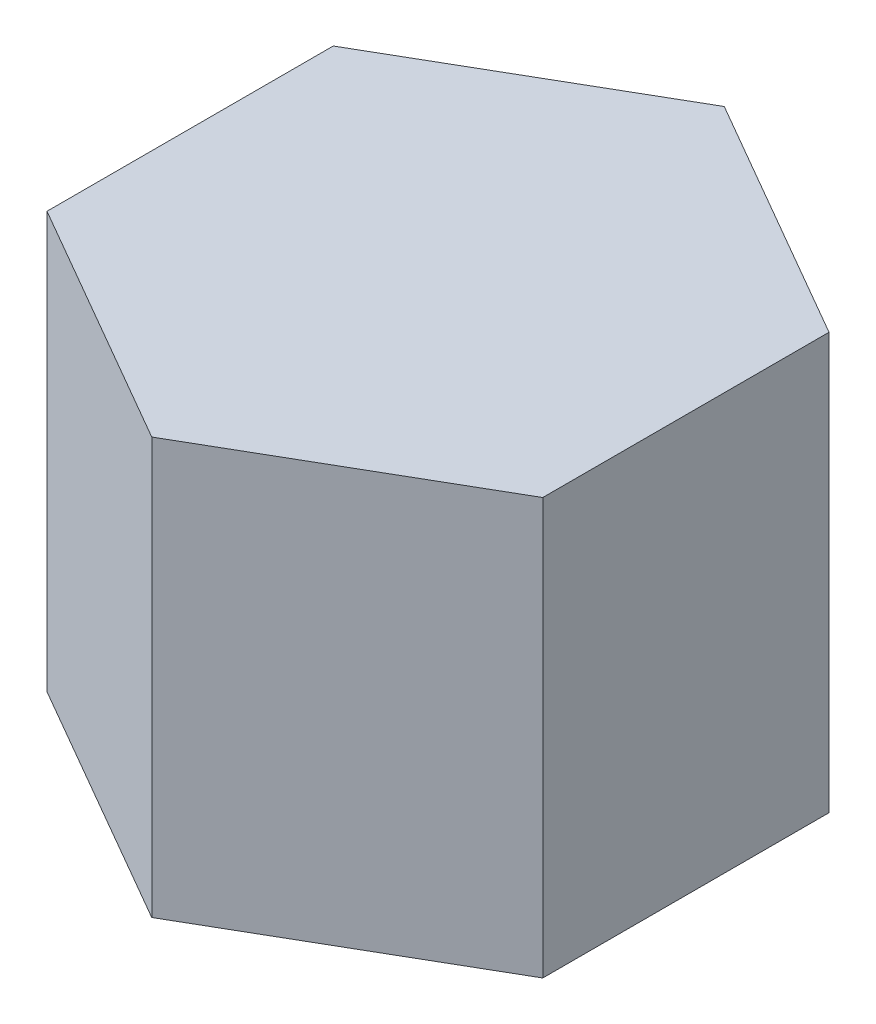
ISO-10303-21;
HEADER;
FILE_DESCRIPTION(('STEP AP214'),'2;1');
FILE_NAME('part.step','',(''),(''),'','','');
FILE_SCHEMA(('AUTOMOTIVE_DESIGN { 1 0 10303 214 1 1 1 1 }'));
ENDSEC;
DATA;
#1=APPLICATION_CONTEXT('core data for automotive mechanical design processes');
#2=APPLICATION_PROTOCOL_DEFINITION('international standard','automotive_design',2000,#1);
#3=PRODUCT_CONTEXT('',#1,'mechanical');
#4=PRODUCT('Part','Part','',(#3));
#5=PRODUCT_RELATED_PRODUCT_CATEGORY('part','',(#4));
#6=PRODUCT_DEFINITION_FORMATION('','',#4);
#7=PRODUCT_DEFINITION_CONTEXT('part definition',#1,'design');
#8=PRODUCT_DEFINITION('design','',#6,#7);
#9=PRODUCT_DEFINITION_SHAPE('','',#8);
#10=(LENGTH_UNIT() NAMED_UNIT(*) SI_UNIT(.MILLI.,.METRE.));
#11=(NAMED_UNIT(*) PLANE_ANGLE_UNIT() SI_UNIT($,.RADIAN.));
#12=(NAMED_UNIT(*) SI_UNIT($,.STERADIAN.) SOLID_ANGLE_UNIT());
#13=UNCERTAINTY_MEASURE_WITH_UNIT(LENGTH_MEASURE(1.E-05),#10,'distance_accuracy_value','');
#14=(GEOMETRIC_REPRESENTATION_CONTEXT(3) GLOBAL_UNCERTAINTY_ASSIGNED_CONTEXT((#13)) GLOBAL_UNIT_ASSIGNED_CONTEXT((#10,
#11,#12)) REPRESENTATION_CONTEXT('',''));
#15=CARTESIAN_POINT('',(0.,0.,0.));
#16=DIRECTION('',(0.,0.,1.));
#17=DIRECTION('',(1.,0.,0.));
#18=AXIS2_PLACEMENT_3D('',#15,#16,#17);
#19=CARTESIAN_POINT('',(206.339551417382,-147.556598747966,289.949920412926));
#20=DIRECTION('',(-0.499999999999943,0.,-0.866025403784471));
#21=DIRECTION('',(-0.866025403784471,0.,0.499999999999943));
#22=AXIS2_PLACEMENT_3D('',#19,#20,#21);
#23=PLANE('',#22);
#24=CARTESIAN_POINT('',(206.642660308706,-147.047793579175,289.774920412926));
#25=DIRECTION('',(-0.866025403784471,0.,0.499999999999943));
#26=VECTOR('',#25,1.);
#27=LINE('',#24,#26);
#28=CARTESIAN_POINT('',(206.642660308706,-147.047793579175,289.774920412926));
#29=VERTEX_POINT('',#28);
#30=CARTESIAN_POINT('',(206.339551417382,-147.047793579175,289.949920412926));
#31=VERTEX_POINT('',#30);
#32=EDGE_CURVE('E170',#29,#31,#27,.T.);
#33=ORIENTED_EDGE('',*,*,#32,.T.);
#34=CARTESIAN_POINT('',(206.339551417382,-147.556598747966,289.949920412926));
#35=DIRECTION('',(0.,1.,0.));
#36=VECTOR('',#35,1.);
#37=LINE('',#34,#36);
#38=CARTESIAN_POINT('',(206.339551417382,-147.556598747966,289.949920412926));
#39=VERTEX_POINT('',#38);
#40=EDGE_CURVE('E35',#39,#31,#37,.T.);
#41=ORIENTED_EDGE('',*,*,#40,.F.);
#42=CARTESIAN_POINT('',(206.642660308706,-147.556598747966,289.774920412926));
#43=DIRECTION('',(-0.866025403784471,0.,0.499999999999943));
#44=VECTOR('',#43,1.);
#45=LINE('',#42,#44);
#46=CARTESIAN_POINT('',(206.642660308706,-147.556598747966,289.774920412926));
#47=VERTEX_POINT('',#46);
#48=EDGE_CURVE('E159',#47,#39,#45,.T.);
#49=ORIENTED_EDGE('',*,*,#48,.F.);
#50=CARTESIAN_POINT('',(206.642660308706,-147.556598747966,289.774920412926));
#51=DIRECTION('',(0.,1.,0.));
#52=VECTOR('',#51,1.);
#53=LINE('',#50,#52);
#54=EDGE_CURVE('E10',#47,#29,#53,.T.);
#55=ORIENTED_EDGE('',*,*,#54,.T.);
#56=EDGE_LOOP('',(#33,#41,#49,#55));
#57=FACE_BOUND('',#56,.T.);
#58=ADVANCED_FACE('F16',(#57),#23,.F.);
#59=CARTESIAN_POINT('',(206.642660308706,-147.556598747966,291.594471220494));
#60=DIRECTION('',(-1.,0.,0.));
#61=DIRECTION('',(0.,-1.,0.));
#62=AXIS2_PLACEMENT_3D('',#59,#60,#61);
#63=PLANE('',#62);
#64=CARTESIAN_POINT('',(206.642660308706,-147.047793579175,289.424920412926));
#65=DIRECTION('',(0.,0.,1.));
#66=VECTOR('',#65,1.);
#67=LINE('',#64,#66);
#68=CARTESIAN_POINT('',(206.642660308706,-147.047793579175,289.424920412926));
#69=VERTEX_POINT('',#68);
#70=EDGE_CURVE('E167',#69,#29,#67,.T.);
#71=ORIENTED_EDGE('',*,*,#70,.T.);
#72=ORIENTED_EDGE('',*,*,#54,.F.);
#73=CARTESIAN_POINT('',(206.642660308706,-147.556598747966,289.424920412926));
#74=DIRECTION('',(0.,0.,1.));
#75=VECTOR('',#74,1.);
#76=LINE('',#73,#75);
#77=CARTESIAN_POINT('',(206.642660308706,-147.556598747966,289.424920412926));
#78=VERTEX_POINT('',#77);
#79=EDGE_CURVE('E156',#78,#47,#76,.T.);
#80=ORIENTED_EDGE('',*,*,#79,.F.);
#81=CARTESIAN_POINT('',(206.642660308706,-147.556598747966,289.424920412926));
#82=DIRECTION('',(0.,1.,0.));
#83=VECTOR('',#82,1.);
#84=LINE('',#81,#83);
#85=EDGE_CURVE('E27',#78,#69,#84,.T.);
#86=ORIENTED_EDGE('',*,*,#85,.T.);
#87=EDGE_LOOP('',(#71,#72,#80,#86));
#88=FACE_BOUND('',#87,.T.);
#89=ADVANCED_FACE('F189',(#88),#63,.F.);
#90=CARTESIAN_POINT('',(206.642660308706,-147.556598747966,289.424920412926));
#91=DIRECTION('',(-0.499999999999943,0.,0.866025403784471));
#92=DIRECTION('',(0.866025403784471,0.,0.499999999999943));
#93=AXIS2_PLACEMENT_3D('',#90,#91,#92);
#94=PLANE('',#93);
#95=CARTESIAN_POINT('',(206.339551417382,-147.047793579175,289.249920412926));
#96=DIRECTION('',(0.866025403784471,0.,0.499999999999943));
#97=VECTOR('',#96,1.);
#98=LINE('',#95,#97);
#99=CARTESIAN_POINT('',(206.339551417382,-147.047793579175,289.249920412926));
#100=VERTEX_POINT('',#99);
#101=EDGE_CURVE('E163',#100,#69,#98,.T.);
#102=ORIENTED_EDGE('',*,*,#101,.T.);
#103=ORIENTED_EDGE('',*,*,#85,.F.);
#104=CARTESIAN_POINT('',(206.339551417382,-147.556598747966,289.249920412926));
#105=DIRECTION('',(0.866025403784471,0.,0.499999999999943));
#106=VECTOR('',#105,1.);
#107=LINE('',#104,#106);
#108=CARTESIAN_POINT('',(206.339551417382,-147.556598747966,289.249920412926));
#109=VERTEX_POINT('',#108);
#110=EDGE_CURVE('E106',#109,#78,#107,.T.);
#111=ORIENTED_EDGE('',*,*,#110,.F.);
#112=CARTESIAN_POINT('',(206.339551417382,-147.556598747966,289.249920412926));
#113=DIRECTION('',(0.,1.,0.));
#114=VECTOR('',#113,1.);
#115=LINE('',#112,#114);
#116=EDGE_CURVE('E94',#109,#100,#115,.T.);
#117=ORIENTED_EDGE('',*,*,#116,.T.);
#118=EDGE_LOOP('',(#102,#103,#111,#117));
#119=FACE_BOUND('',#118,.T.);
#120=ADVANCED_FACE('F198',(#119),#94,.F.);
#121=CARTESIAN_POINT('',(206.339551417382,-147.556598747966,289.249920412926));
#122=DIRECTION('',(0.499999999999978,0.,0.866025403784452));
#123=DIRECTION('',(0.866025403784452,0.,-0.499999999999978));
#124=AXIS2_PLACEMENT_3D('',#121,#122,#123);
#125=PLANE('',#124);
#126=CARTESIAN_POINT('',(206.036442526057,-147.047793579175,289.424920412926));
#127=DIRECTION('',(0.866025403784452,0.,-0.499999999999978));
#128=VECTOR('',#127,1.);
#129=LINE('',#126,#128);
#130=CARTESIAN_POINT('',(206.036442526057,-147.047793579175,289.424920412926));
#131=VERTEX_POINT('',#130);
#132=EDGE_CURVE('E162',#131,#100,#129,.T.);
#133=ORIENTED_EDGE('',*,*,#132,.T.);
#134=ORIENTED_EDGE('',*,*,#116,.F.);
#135=CARTESIAN_POINT('',(206.036442526057,-147.556598747966,289.424920412926));
#136=DIRECTION('',(0.866025403784452,0.,-0.499999999999978));
#137=VECTOR('',#136,1.);
#138=LINE('',#135,#137);
#139=CARTESIAN_POINT('',(206.036442526057,-147.556598747966,289.424920412926));
#140=VERTEX_POINT('',#139);
#141=EDGE_CURVE('E98',#140,#109,#138,.T.);
#142=ORIENTED_EDGE('',*,*,#141,.F.);
#143=CARTESIAN_POINT('',(206.036442526057,-147.556598747966,289.424920412926));
#144=DIRECTION('',(0.,1.,0.));
#145=VECTOR('',#144,1.);
#146=LINE('',#143,#145);
#147=EDGE_CURVE('E79',#140,#131,#146,.T.);
#148=ORIENTED_EDGE('',*,*,#147,.T.);
#149=EDGE_LOOP('',(#133,#134,#142,#148));
#150=FACE_BOUND('',#149,.T.);
#151=ADVANCED_FACE('F100',(#150),#125,.F.);
#152=CARTESIAN_POINT('',(206.036442526057,-147.556598747966,291.594471220494));
#153=DIRECTION('',(1.,0.,0.));
#154=DIRECTION('',(0.,1.,0.));
#155=AXIS2_PLACEMENT_3D('',#152,#153,#154);
#156=PLANE('',#155);
#157=CARTESIAN_POINT('',(206.036442526057,-147.047793579175,289.774920412926));
#158=DIRECTION('',(0.,0.,-1.));
#159=VECTOR('',#158,1.);
#160=LINE('',#157,#159);
#161=CARTESIAN_POINT('',(206.036442526057,-147.047793579175,289.774920412926));
#162=VERTEX_POINT('',#161);
#163=EDGE_CURVE('E88',#162,#131,#160,.T.);
#164=ORIENTED_EDGE('',*,*,#163,.T.);
#165=ORIENTED_EDGE('',*,*,#147,.F.);
#166=CARTESIAN_POINT('',(206.036442526057,-147.556598747966,289.774920412926));
#167=DIRECTION('',(0.,0.,-1.));
#168=VECTOR('',#167,1.);
#169=LINE('',#166,#168);
#170=CARTESIAN_POINT('',(206.036442526057,-147.556598747966,289.774920412926));
#171=VERTEX_POINT('',#170);
#172=EDGE_CURVE('E84',#171,#140,#169,.T.);
#173=ORIENTED_EDGE('',*,*,#172,.F.);
#174=CARTESIAN_POINT('',(206.036442526057,-147.556598747966,289.774920412926));
#175=DIRECTION('',(0.,1.,0.));
#176=VECTOR('',#175,1.);
#177=LINE('',#174,#176);
#178=EDGE_CURVE('E58',#171,#162,#177,.T.);
#179=ORIENTED_EDGE('',*,*,#178,.T.);
#180=EDGE_LOOP('',(#164,#165,#173,#179));
#181=FACE_BOUND('',#180,.T.);
#182=ADVANCED_FACE('F82',(#181),#156,.F.);
#183=CARTESIAN_POINT('',(206.036442526057,-147.556598747966,289.774920412926));
#184=DIRECTION('',(0.499999999999943,0.,-0.866025403784471));
#185=DIRECTION('',(-0.866025403784471,0.,-0.499999999999943));
#186=AXIS2_PLACEMENT_3D('',#183,#184,#185);
#187=PLANE('',#186);
#188=CARTESIAN_POINT('',(206.339551417382,-147.047793579175,289.949920412926));
#189=DIRECTION('',(-0.866025403784471,0.,-0.499999999999943));
#190=VECTOR('',#189,1.);
#191=LINE('',#188,#190);
#192=EDGE_CURVE('E160',#31,#162,#191,.T.);
#193=ORIENTED_EDGE('',*,*,#192,.T.);
#194=ORIENTED_EDGE('',*,*,#178,.F.);
#195=CARTESIAN_POINT('',(206.339551417382,-147.556598747966,289.949920412926));
#196=DIRECTION('',(-0.866025403784471,0.,-0.499999999999943));
#197=VECTOR('',#196,1.);
#198=LINE('',#195,#197);
#199=EDGE_CURVE('E112',#39,#171,#198,.T.);
#200=ORIENTED_EDGE('',*,*,#199,.F.);
#201=ORIENTED_EDGE('',*,*,#40,.T.);
#202=EDGE_LOOP('',(#193,#194,#200,#201));
#203=FACE_BOUND('',#202,.T.);
#204=ADVANCED_FACE('F131',(#203),#187,.F.);
#205=CARTESIAN_POINT('',(206.491105863044,-147.556598747966,291.594471220494));
#206=DIRECTION('',(0.,1.,0.));
#207=DIRECTION('',(-1.,0.,0.));
#208=AXIS2_PLACEMENT_3D('',#205,#206,#207);
#209=PLANE('',#208);
#210=ORIENTED_EDGE('',*,*,#48,.T.);
#211=ORIENTED_EDGE('',*,*,#199,.T.);
#212=ORIENTED_EDGE('',*,*,#172,.T.);
#213=ORIENTED_EDGE('',*,*,#141,.T.);
#214=ORIENTED_EDGE('',*,*,#110,.T.);
#215=ORIENTED_EDGE('',*,*,#79,.T.);
#216=EDGE_LOOP('',(#210,#211,#212,#213,#214,#215));
#217=FACE_BOUND('',#216,.T.);
#218=ADVANCED_FACE('F111',(#217),#209,.F.);
#219=CARTESIAN_POINT('',(206.491105863044,-147.047793579175,291.594471220494));
#220=DIRECTION('',(0.,1.,0.));
#221=DIRECTION('',(-1.,0.,0.));
#222=AXIS2_PLACEMENT_3D('',#219,#220,#221);
#223=PLANE('',#222);
#224=ORIENTED_EDGE('',*,*,#32,.F.);
#225=ORIENTED_EDGE('',*,*,#70,.F.);
#226=ORIENTED_EDGE('',*,*,#101,.F.);
#227=ORIENTED_EDGE('',*,*,#132,.F.);
#228=ORIENTED_EDGE('',*,*,#163,.F.);
#229=ORIENTED_EDGE('',*,*,#192,.F.);
#230=EDGE_LOOP('',(#224,#225,#226,#227,#228,#229));
#231=FACE_BOUND('',#230,.T.);
#232=ADVANCED_FACE('F130',(#231),#223,.T.);
#233=CLOSED_SHELL('',(#58,#89,#120,#151,#182,#204,#218,#232));
#234=MANIFOLD_SOLID_BREP('B1',#233);
#235=ADVANCED_BREP_SHAPE_REPRESENTATION('',(#18,#234),#14);
#236=SHAPE_DEFINITION_REPRESENTATION(#9,#235);
ENDSEC;
END-ISO-10303-21;
